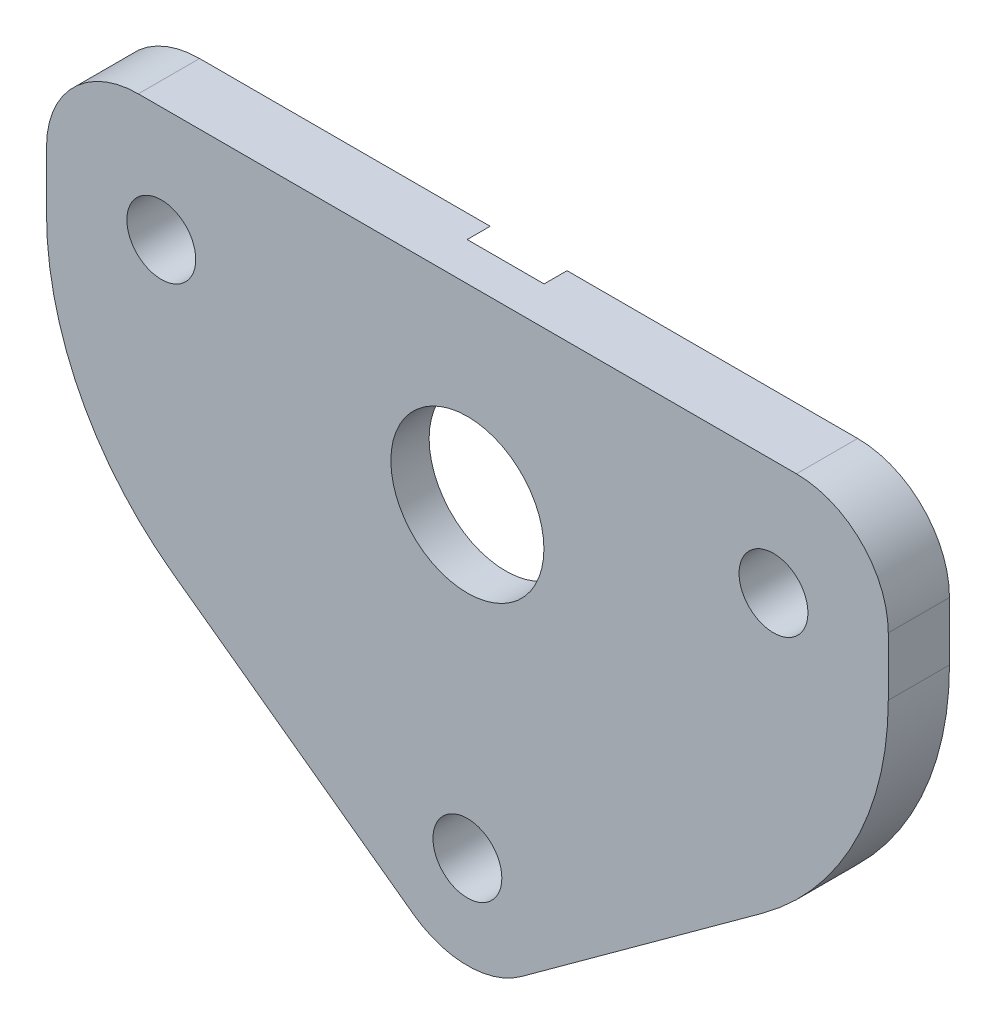
ISO-10303-21;
HEADER;
FILE_DESCRIPTION(('STEP AP214'),'2;1');
FILE_NAME('part.step','',(''),(''),'','','');
FILE_SCHEMA(('AUTOMOTIVE_DESIGN { 1 0 10303 214 1 1 1 1 }'));
ENDSEC;
DATA;
#1=APPLICATION_CONTEXT('core data for automotive mechanical design processes');
#2=APPLICATION_PROTOCOL_DEFINITION('international standard','automotive_design',2000,#1);
#3=PRODUCT_CONTEXT('',#1,'mechanical');
#4=PRODUCT('Part','Part','',(#3));
#5=PRODUCT_RELATED_PRODUCT_CATEGORY('part','',(#4));
#6=PRODUCT_DEFINITION_FORMATION('','',#4);
#7=PRODUCT_DEFINITION_CONTEXT('part definition',#1,'design');
#8=PRODUCT_DEFINITION('design','',#6,#7);
#9=PRODUCT_DEFINITION_SHAPE('','',#8);
#10=(LENGTH_UNIT() NAMED_UNIT(*) SI_UNIT(.MILLI.,.METRE.));
#11=(NAMED_UNIT(*) PLANE_ANGLE_UNIT() SI_UNIT($,.RADIAN.));
#12=(NAMED_UNIT(*) SI_UNIT($,.STERADIAN.) SOLID_ANGLE_UNIT());
#13=UNCERTAINTY_MEASURE_WITH_UNIT(LENGTH_MEASURE(1.E-05),#10,'distance_accuracy_value','');
#14=(GEOMETRIC_REPRESENTATION_CONTEXT(3) GLOBAL_UNCERTAINTY_ASSIGNED_CONTEXT((#13)) GLOBAL_UNIT_ASSIGNED_CONTEXT((#10,
#11,#12)) REPRESENTATION_CONTEXT('',''));
#15=CARTESIAN_POINT('',(0.,0.,0.));
#16=DIRECTION('',(0.,0.,1.));
#17=DIRECTION('',(1.,0.,0.));
#18=AXIS2_PLACEMENT_3D('',#15,#16,#17);
#19=CARTESIAN_POINT('',(-27.5,27.5,4.));
#20=DIRECTION('',(0.,0.,-1.));
#21=DIRECTION('',(-1.,0.,0.));
#22=AXIS2_PLACEMENT_3D('',#19,#20,#21);
#23=CYLINDRICAL_SURFACE('',#22,5.);
#24=CARTESIAN_POINT('',(-27.5,27.5,4.));
#25=DIRECTION('',(0.,0.,1.));
#26=DIRECTION('',(1.,0.,0.));
#27=AXIS2_PLACEMENT_3D('',#24,#25,#26);
#28=CIRCLE('',#27,5.);
#29=CARTESIAN_POINT('',(-22.5,27.5,4.));
#30=VERTEX_POINT('',#29);
#31=EDGE_CURVE('E224',#30,#30,#28,.T.);
#32=ORIENTED_EDGE('',*,*,#31,.T.);
#33=EDGE_LOOP('',(#32));
#34=FACE_BOUND('',#33,.T.);
#35=CARTESIAN_POINT('',(-27.5,27.5,1.5));
#36=DIRECTION('',(0.,0.,-1.));
#37=DIRECTION('',(-1.,0.,0.));
#38=AXIS2_PLACEMENT_3D('',#35,#36,#37);
#39=CIRCLE('',#38,5.);
#40=CARTESIAN_POINT('',(-32.5,27.5,1.5));
#41=VERTEX_POINT('',#40);
#42=EDGE_CURVE('E197',#41,#41,#39,.T.);
#43=ORIENTED_EDGE('',*,*,#42,.T.);
#44=EDGE_LOOP('',(#43));
#45=FACE_BOUND('',#44,.T.);
#46=ADVANCED_FACE('F33',(#34,#45),#23,.F.);
#47=CARTESIAN_POINT('',(0.,0.,4.));
#48=DIRECTION('',(0.,0.,1.));
#49=DIRECTION('',(1.,0.,0.));
#50=AXIS2_PLACEMENT_3D('',#47,#48,#49);
#51=PLANE('',#50);
#52=CARTESIAN_POINT('',(-7.5,32.5,4.));
#53=DIRECTION('',(0.,0.,1.));
#54=DIRECTION('',(1.,0.,0.));
#55=AXIS2_PLACEMENT_3D('',#52,#53,#54);
#56=CIRCLE('',#55,2.25);
#57=CARTESIAN_POINT('',(-5.25,32.5,4.));
#58=VERTEX_POINT('',#57);
#59=EDGE_CURVE('E240',#58,#58,#56,.T.);
#60=ORIENTED_EDGE('',*,*,#59,.F.);
#61=EDGE_LOOP('',(#60));
#62=FACE_BOUND('',#61,.T.);
#63=ORIENTED_EDGE('',*,*,#31,.F.);
#64=EDGE_LOOP('',(#63));
#65=FACE_BOUND('',#64,.T.);
#66=DIRECTION('',(0.,-1.,0.));
#67=VECTOR('',#66,1.);
#68=CARTESIAN_POINT('',(-55.,40.,4.));
#69=LINE('',#68,#67);
#70=CARTESIAN_POINT('',(-55.,34.,4.));
#71=VERTEX_POINT('',#70);
#72=CARTESIAN_POINT('',(-55.,30.1844918340644,4.));
#73=VERTEX_POINT('',#72);
#74=EDGE_CURVE('E144',#71,#73,#69,.T.);
#75=ORIENTED_EDGE('',*,*,#74,.T.);
#76=CARTESIAN_POINT('',(-35.,30.1844918340644,4.));
#77=DIRECTION('',(0.,0.,1.));
#78=DIRECTION('',(1.,0.,0.));
#79=AXIS2_PLACEMENT_3D('',#76,#77,#78);
#80=CIRCLE('',#79,20.);
#81=CARTESIAN_POINT('',(-46.7634339535009,14.0097701480007,4.));
#82=VERTEX_POINT('',#81);
#83=EDGE_CURVE('E190',#73,#82,#80,.T.);
#84=ORIENTED_EDGE('',*,*,#83,.T.);
#85=DIRECTION('',(0.808736084303188,-0.588171697675046,0.));
#86=VECTOR('',#85,1.);
#87=CARTESIAN_POINT('',(-55.,20.,4.));
#88=LINE('',#87,#86);
#89=CARTESIAN_POINT('',(-31.0290301860503,2.56656740803657,4.));
#90=VERTEX_POINT('',#89);
#91=EDGE_CURVE('E230',#82,#90,#88,.T.);
#92=ORIENTED_EDGE('',*,*,#91,.T.);
#93=CARTESIAN_POINT('',(-27.5,7.4189839138557,4.));
#94=DIRECTION('',(0.,0.,1.));
#95=DIRECTION('',(1.,0.,0.));
#96=AXIS2_PLACEMENT_3D('',#93,#94,#95);
#97=CIRCLE('',#96,6.);
#98=CARTESIAN_POINT('',(-23.9709698139497,2.56656740803657,4.));
#99=VERTEX_POINT('',#98);
#100=EDGE_CURVE('E167',#90,#99,#97,.T.);
#101=ORIENTED_EDGE('',*,*,#100,.T.);
#102=DIRECTION('',(0.808736084303188,0.588171697675046,0.));
#103=VECTOR('',#102,1.);
#104=CARTESIAN_POINT('',(-27.5,0.,4.));
#105=LINE('',#104,#103);
#106=CARTESIAN_POINT('',(-8.23656604649908,14.0097701480007,4.));
#107=VERTEX_POINT('',#106);
#108=EDGE_CURVE('E228',#99,#107,#105,.T.);
#109=ORIENTED_EDGE('',*,*,#108,.T.);
#110=CARTESIAN_POINT('',(-20.,30.1844918340644,4.));
#111=DIRECTION('',(0.,0.,1.));
#112=DIRECTION('',(1.,0.,0.));
#113=AXIS2_PLACEMENT_3D('',#110,#111,#112);
#114=CIRCLE('',#113,20.);
#115=CARTESIAN_POINT('',(0.,30.1844918340644,4.));
#116=VERTEX_POINT('',#115);
#117=EDGE_CURVE('E55',#107,#116,#114,.T.);
#118=ORIENTED_EDGE('',*,*,#117,.T.);
#119=DIRECTION('',(0.,1.,0.));
#120=VECTOR('',#119,1.);
#121=CARTESIAN_POINT('',(0.,40.,4.));
#122=LINE('',#121,#120);
#123=CARTESIAN_POINT('',(0.,34.,4.));
#124=VERTEX_POINT('',#123);
#125=EDGE_CURVE('E208',#116,#124,#122,.T.);
#126=ORIENTED_EDGE('',*,*,#125,.T.);
#127=CARTESIAN_POINT('',(-6.,34.,4.));
#128=DIRECTION('',(0.,0.,1.));
#129=DIRECTION('',(1.,0.,0.));
#130=AXIS2_PLACEMENT_3D('',#127,#128,#129);
#131=CIRCLE('',#130,6.);
#132=CARTESIAN_POINT('',(-6.,40.,4.));
#133=VERTEX_POINT('',#132);
#134=EDGE_CURVE('E163',#124,#133,#131,.T.);
#135=ORIENTED_EDGE('',*,*,#134,.T.);
#136=DIRECTION('',(-1.,0.,0.));
#137=VECTOR('',#136,1.);
#138=CARTESIAN_POINT('',(-55.,40.,4.));
#139=LINE('',#138,#137);
#140=CARTESIAN_POINT('',(-49.,40.,4.));
#141=VERTEX_POINT('',#140);
#142=EDGE_CURVE('E153',#133,#141,#139,.T.);
#143=ORIENTED_EDGE('',*,*,#142,.T.);
#144=CARTESIAN_POINT('',(-49.,34.,4.));
#145=DIRECTION('',(0.,0.,1.));
#146=DIRECTION('',(1.,0.,0.));
#147=AXIS2_PLACEMENT_3D('',#144,#145,#146);
#148=CIRCLE('',#147,6.);
#149=EDGE_CURVE('E165',#141,#71,#148,.T.);
#150=ORIENTED_EDGE('',*,*,#149,.T.);
#151=EDGE_LOOP('',(#75,#84,#92,#101,#109,#118,#126,#135,#143,#150));
#152=FACE_BOUND('',#151,.T.);
#153=CARTESIAN_POINT('',(-47.5,32.5,4.));
#154=DIRECTION('',(0.,0.,1.));
#155=DIRECTION('',(1.,0.,0.));
#156=AXIS2_PLACEMENT_3D('',#153,#154,#155);
#157=CIRCLE('',#156,2.25);
#158=CARTESIAN_POINT('',(-45.25,32.5,4.));
#159=VERTEX_POINT('',#158);
#160=EDGE_CURVE('E236',#159,#159,#157,.T.);
#161=ORIENTED_EDGE('',*,*,#160,.F.);
#162=EDGE_LOOP('',(#161));
#163=FACE_BOUND('',#162,.T.);
#164=CARTESIAN_POINT('',(-27.5,7.5,4.));
#165=DIRECTION('',(0.,0.,1.));
#166=DIRECTION('',(1.,0.,0.));
#167=AXIS2_PLACEMENT_3D('',#164,#165,#166);
#168=CIRCLE('',#167,2.25);
#169=CARTESIAN_POINT('',(-25.25,7.5,4.));
#170=VERTEX_POINT('',#169);
#171=EDGE_CURVE('E246',#170,#170,#168,.T.);
#172=ORIENTED_EDGE('',*,*,#171,.F.);
#173=EDGE_LOOP('',(#172));
#174=FACE_BOUND('',#173,.T.);
#175=ADVANCED_FACE('F265',(#62,#65,#152,#163,#174),#51,.T.);
#176=CARTESIAN_POINT('',(0.,0.,0.));
#177=DIRECTION('',(0.,0.,1.));
#178=DIRECTION('',(1.,0.,0.));
#179=AXIS2_PLACEMENT_3D('',#176,#177,#178);
#180=PLANE('',#179);
#181=DIRECTION('',(-1.,0.,0.));
#182=VECTOR('',#181,1.);
#183=CARTESIAN_POINT('',(-55.,40.,0.));
#184=LINE('',#183,#182);
#185=CARTESIAN_POINT('',(-30.0124689052802,40.,0.));
#186=VERTEX_POINT('',#185);
#187=CARTESIAN_POINT('',(-49.,40.,0.));
#188=VERTEX_POINT('',#187);
#189=EDGE_CURVE('E133',#186,#188,#184,.T.);
#190=ORIENTED_EDGE('',*,*,#189,.F.);
#191=CARTESIAN_POINT('',(-27.5,27.5,0.));
#192=DIRECTION('',(0.,0.,-1.));
#193=DIRECTION('',(-1.,0.,0.));
#194=AXIS2_PLACEMENT_3D('',#191,#192,#193);
#195=CIRCLE('',#194,12.75);
#196=CARTESIAN_POINT('',(-24.9875310947198,40.,0.));
#197=VERTEX_POINT('',#196);
#198=EDGE_CURVE('E122',#197,#186,#195,.T.);
#199=ORIENTED_EDGE('',*,*,#198,.F.);
#200=CARTESIAN_POINT('',(-6.,40.,0.));
#201=VERTEX_POINT('',#200);
#202=EDGE_CURVE('E141',#201,#197,#184,.T.);
#203=ORIENTED_EDGE('',*,*,#202,.F.);
#204=CARTESIAN_POINT('',(-6.,34.,0.));
#205=DIRECTION('',(0.,0.,1.));
#206=DIRECTION('',(1.,0.,0.));
#207=AXIS2_PLACEMENT_3D('',#204,#205,#206);
#208=CIRCLE('',#207,6.);
#209=CARTESIAN_POINT('',(0.,34.,0.));
#210=VERTEX_POINT('',#209);
#211=EDGE_CURVE('E152',#201,#210,#208,.F.);
#212=ORIENTED_EDGE('',*,*,#211,.T.);
#213=DIRECTION('',(0.,1.,0.));
#214=VECTOR('',#213,1.);
#215=CARTESIAN_POINT('',(0.,40.,0.));
#216=LINE('',#215,#214);
#217=CARTESIAN_POINT('',(0.,30.1844918340644,0.));
#218=VERTEX_POINT('',#217);
#219=EDGE_CURVE('E142',#218,#210,#216,.T.);
#220=ORIENTED_EDGE('',*,*,#219,.F.);
#221=CARTESIAN_POINT('',(-20.,30.1844918340644,0.));
#222=DIRECTION('',(0.,0.,1.));
#223=DIRECTION('',(1.,0.,0.));
#224=AXIS2_PLACEMENT_3D('',#221,#222,#223);
#225=CIRCLE('',#224,20.);
#226=CARTESIAN_POINT('',(-8.23656604649908,14.0097701480007,0.));
#227=VERTEX_POINT('',#226);
#228=EDGE_CURVE('E183',#218,#227,#225,.F.);
#229=ORIENTED_EDGE('',*,*,#228,.T.);
#230=DIRECTION('',(0.808736084303188,0.588171697675046,0.));
#231=VECTOR('',#230,1.);
#232=CARTESIAN_POINT('',(-27.5,0.,0.));
#233=LINE('',#232,#231);
#234=CARTESIAN_POINT('',(-23.9709698139497,2.56656740803657,0.));
#235=VERTEX_POINT('',#234);
#236=EDGE_CURVE('E145',#235,#227,#233,.T.);
#237=ORIENTED_EDGE('',*,*,#236,.F.);
#238=CARTESIAN_POINT('',(-27.5,7.4189839138557,0.));
#239=DIRECTION('',(0.,0.,1.));
#240=DIRECTION('',(1.,0.,0.));
#241=AXIS2_PLACEMENT_3D('',#238,#239,#240);
#242=CIRCLE('',#241,6.);
#243=CARTESIAN_POINT('',(-31.0290301860503,2.56656740803657,0.));
#244=VERTEX_POINT('',#243);
#245=EDGE_CURVE('E157',#235,#244,#242,.F.);
#246=ORIENTED_EDGE('',*,*,#245,.T.);
#247=DIRECTION('',(0.808736084303188,-0.588171697675046,0.));
#248=VECTOR('',#247,1.);
#249=CARTESIAN_POINT('',(-55.,20.,0.));
#250=LINE('',#249,#248);
#251=CARTESIAN_POINT('',(-46.7634339535009,14.0097701480007,0.));
#252=VERTEX_POINT('',#251);
#253=EDGE_CURVE('E218',#252,#244,#250,.T.);
#254=ORIENTED_EDGE('',*,*,#253,.F.);
#255=CARTESIAN_POINT('',(-35.,30.1844918340644,0.));
#256=DIRECTION('',(0.,0.,1.));
#257=DIRECTION('',(1.,0.,0.));
#258=AXIS2_PLACEMENT_3D('',#255,#256,#257);
#259=CIRCLE('',#258,20.);
#260=CARTESIAN_POINT('',(-55.,30.1844918340644,0.));
#261=VERTEX_POINT('',#260);
#262=EDGE_CURVE('E185',#252,#261,#259,.F.);
#263=ORIENTED_EDGE('',*,*,#262,.T.);
#264=DIRECTION('',(0.,-1.,0.));
#265=VECTOR('',#264,1.);
#266=CARTESIAN_POINT('',(-55.,40.,0.));
#267=LINE('',#266,#265);
#268=CARTESIAN_POINT('',(-55.,34.,0.));
#269=VERTEX_POINT('',#268);
#270=EDGE_CURVE('E219',#269,#261,#267,.T.);
#271=ORIENTED_EDGE('',*,*,#270,.F.);
#272=CARTESIAN_POINT('',(-49.,34.,0.));
#273=DIRECTION('',(0.,0.,1.));
#274=DIRECTION('',(1.,0.,0.));
#275=AXIS2_PLACEMENT_3D('',#272,#273,#274);
#276=CIRCLE('',#275,6.);
#277=EDGE_CURVE('E139',#269,#188,#276,.F.);
#278=ORIENTED_EDGE('',*,*,#277,.T.);
#279=EDGE_LOOP('',(#190,#199,#203,#212,#220,#229,#237,#246,#254,#263,#271,#278));
#280=FACE_BOUND('',#279,.T.);
#281=CARTESIAN_POINT('',(-47.5,32.5,0.));
#282=DIRECTION('',(0.,0.,1.));
#283=DIRECTION('',(1.,0.,0.));
#284=AXIS2_PLACEMENT_3D('',#281,#282,#283);
#285=CIRCLE('',#284,2.25);
#286=CARTESIAN_POINT('',(-45.25,32.5,0.));
#287=VERTEX_POINT('',#286);
#288=EDGE_CURVE('E237',#287,#287,#285,.T.);
#289=ORIENTED_EDGE('',*,*,#288,.T.);
#290=EDGE_LOOP('',(#289));
#291=FACE_BOUND('',#290,.T.);
#292=CARTESIAN_POINT('',(-7.5,32.5,0.));
#293=DIRECTION('',(0.,0.,1.));
#294=DIRECTION('',(1.,0.,0.));
#295=AXIS2_PLACEMENT_3D('',#292,#293,#294);
#296=CIRCLE('',#295,2.25);
#297=CARTESIAN_POINT('',(-5.25,32.5,0.));
#298=VERTEX_POINT('',#297);
#299=EDGE_CURVE('E243',#298,#298,#296,.T.);
#300=ORIENTED_EDGE('',*,*,#299,.T.);
#301=EDGE_LOOP('',(#300));
#302=FACE_BOUND('',#301,.T.);
#303=CARTESIAN_POINT('',(-27.5,7.5,0.));
#304=DIRECTION('',(0.,0.,1.));
#305=DIRECTION('',(1.,0.,0.));
#306=AXIS2_PLACEMENT_3D('',#303,#304,#305);
#307=CIRCLE('',#306,2.25);
#308=CARTESIAN_POINT('',(-25.25,7.5,0.));
#309=VERTEX_POINT('',#308);
#310=EDGE_CURVE('E249',#309,#309,#307,.T.);
#311=ORIENTED_EDGE('',*,*,#310,.T.);
#312=EDGE_LOOP('',(#311));
#313=FACE_BOUND('',#312,.T.);
#314=ADVANCED_FACE('F136',(#280,#291,#302,#313),#180,.F.);
#315=CARTESIAN_POINT('',(-55.,40.,4.));
#316=DIRECTION('',(1.,0.,0.));
#317=DIRECTION('',(0.,1.,0.));
#318=AXIS2_PLACEMENT_3D('',#315,#316,#317);
#319=PLANE('',#318);
#320=ORIENTED_EDGE('',*,*,#270,.T.);
#321=DIRECTION('',(0.,0.,-1.));
#322=VECTOR('',#321,1.);
#323=CARTESIAN_POINT('',(-55.,30.1844918340644,4.));
#324=LINE('',#323,#322);
#325=EDGE_CURVE('E187',#261,#73,#324,.F.);
#326=ORIENTED_EDGE('',*,*,#325,.T.);
#327=ORIENTED_EDGE('',*,*,#74,.F.);
#328=DIRECTION('',(0.,0.,-1.));
#329=VECTOR('',#328,1.);
#330=CARTESIAN_POINT('',(-55.,34.,4.));
#331=LINE('',#330,#329);
#332=EDGE_CURVE('E169',#71,#269,#331,.T.);
#333=ORIENTED_EDGE('',*,*,#332,.T.);
#334=EDGE_LOOP('',(#320,#326,#327,#333));
#335=FACE_BOUND('',#334,.T.);
#336=ADVANCED_FACE('F280',(#335),#319,.F.);
#337=CARTESIAN_POINT('',(-55.,20.,4.));
#338=DIRECTION('',(0.588171697675046,0.808736084303189,0.));
#339=DIRECTION('',(-0.808736084303189,0.588171697675046,0.));
#340=AXIS2_PLACEMENT_3D('',#337,#338,#339);
#341=PLANE('',#340);
#342=ORIENTED_EDGE('',*,*,#91,.F.);
#343=DIRECTION('',(0.,0.,-1.));
#344=VECTOR('',#343,1.);
#345=CARTESIAN_POINT('',(-46.7634339535009,14.0097701480007,4.));
#346=LINE('',#345,#344);
#347=EDGE_CURVE('E180',#82,#252,#346,.T.);
#348=ORIENTED_EDGE('',*,*,#347,.T.);
#349=ORIENTED_EDGE('',*,*,#253,.T.);
#350=DIRECTION('',(0.,0.,-1.));
#351=VECTOR('',#350,1.);
#352=CARTESIAN_POINT('',(-31.0290301860503,2.56656740803657,4.));
#353=LINE('',#352,#351);
#354=EDGE_CURVE('E160',#244,#90,#353,.F.);
#355=ORIENTED_EDGE('',*,*,#354,.T.);
#356=EDGE_LOOP('',(#342,#348,#349,#355));
#357=FACE_BOUND('',#356,.T.);
#358=ADVANCED_FACE('F287',(#357),#341,.F.);
#359=CARTESIAN_POINT('',(-27.5,0.,4.));
#360=DIRECTION('',(-0.588171697675046,0.808736084303189,0.));
#361=DIRECTION('',(-0.808736084303189,-0.588171697675046,0.));
#362=AXIS2_PLACEMENT_3D('',#359,#360,#361);
#363=PLANE('',#362);
#364=ORIENTED_EDGE('',*,*,#236,.T.);
#365=DIRECTION('',(0.,0.,-1.));
#366=VECTOR('',#365,1.);
#367=CARTESIAN_POINT('',(-8.23656604649908,14.0097701480007,4.));
#368=LINE('',#367,#366);
#369=EDGE_CURVE('E195',#227,#107,#368,.F.);
#370=ORIENTED_EDGE('',*,*,#369,.T.);
#371=ORIENTED_EDGE('',*,*,#108,.F.);
#372=DIRECTION('',(0.,0.,-1.));
#373=VECTOR('',#372,1.);
#374=CARTESIAN_POINT('',(-23.9709698139497,2.56656740803657,4.));
#375=LINE('',#374,#373);
#376=EDGE_CURVE('E149',#99,#235,#375,.T.);
#377=ORIENTED_EDGE('',*,*,#376,.T.);
#378=EDGE_LOOP('',(#364,#370,#371,#377));
#379=FACE_BOUND('',#378,.T.);
#380=ADVANCED_FACE('F215',(#379),#363,.F.);
#381=CARTESIAN_POINT('',(0.,40.,4.));
#382=DIRECTION('',(-1.,0.,0.));
#383=DIRECTION('',(0.,0.,1.));
#384=AXIS2_PLACEMENT_3D('',#381,#382,#383);
#385=PLANE('',#384);
#386=ORIENTED_EDGE('',*,*,#125,.F.);
#387=DIRECTION('',(0.,0.,-1.));
#388=VECTOR('',#387,1.);
#389=CARTESIAN_POINT('',(0.,30.1844918340644,4.));
#390=LINE('',#389,#388);
#391=EDGE_CURVE('E192',#116,#218,#390,.T.);
#392=ORIENTED_EDGE('',*,*,#391,.T.);
#393=ORIENTED_EDGE('',*,*,#219,.T.);
#394=DIRECTION('',(0.,0.,-1.));
#395=VECTOR('',#394,1.);
#396=CARTESIAN_POINT('',(0.,34.,4.));
#397=LINE('',#396,#395);
#398=EDGE_CURVE('E177',#210,#124,#397,.F.);
#399=ORIENTED_EDGE('',*,*,#398,.T.);
#400=EDGE_LOOP('',(#386,#392,#393,#399));
#401=FACE_BOUND('',#400,.T.);
#402=ADVANCED_FACE('F207',(#401),#385,.F.);
#403=CARTESIAN_POINT('',(-55.,40.,4.));
#404=DIRECTION('',(0.,-1.,0.));
#405=DIRECTION('',(0.,0.,-1.));
#406=AXIS2_PLACEMENT_3D('',#403,#404,#405);
#407=PLANE('',#406);
#408=DIRECTION('',(1.,0.,0.));
#409=VECTOR('',#408,1.);
#410=CARTESIAN_POINT('',(-55.,40.,1.5));
#411=LINE('',#410,#409);
#412=CARTESIAN_POINT('',(-30.0124689052802,40.,1.5));
#413=VERTEX_POINT('',#412);
#414=CARTESIAN_POINT('',(-24.9875310947198,40.,1.5));
#415=VERTEX_POINT('',#414);
#416=EDGE_CURVE('E135',#413,#415,#411,.T.);
#417=ORIENTED_EDGE('',*,*,#416,.F.);
#418=DIRECTION('',(0.,0.,-1.));
#419=VECTOR('',#418,1.);
#420=CARTESIAN_POINT('',(-30.0124689052802,40.,1.5));
#421=LINE('',#420,#419);
#422=EDGE_CURVE('E11',#413,#186,#421,.T.);
#423=ORIENTED_EDGE('',*,*,#422,.T.);
#424=ORIENTED_EDGE('',*,*,#189,.T.);
#425=DIRECTION('',(0.,0.,-1.));
#426=VECTOR('',#425,1.);
#427=CARTESIAN_POINT('',(-49.,40.,4.));
#428=LINE('',#427,#426);
#429=EDGE_CURVE('E175',#188,#141,#428,.F.);
#430=ORIENTED_EDGE('',*,*,#429,.T.);
#431=ORIENTED_EDGE('',*,*,#142,.F.);
#432=DIRECTION('',(0.,0.,-1.));
#433=VECTOR('',#432,1.);
#434=CARTESIAN_POINT('',(-6.,40.,4.));
#435=LINE('',#434,#433);
#436=EDGE_CURVE('E172',#133,#201,#435,.T.);
#437=ORIENTED_EDGE('',*,*,#436,.T.);
#438=ORIENTED_EDGE('',*,*,#202,.T.);
#439=DIRECTION('',(0.,0.,-1.));
#440=VECTOR('',#439,1.);
#441=CARTESIAN_POINT('',(-24.9875310947198,40.,1.5));
#442=LINE('',#441,#440);
#443=EDGE_CURVE('E41',#197,#415,#442,.F.);
#444=ORIENTED_EDGE('',*,*,#443,.T.);
#445=EDGE_LOOP('',(#417,#423,#424,#430,#431,#437,#438,#444));
#446=FACE_BOUND('',#445,.T.);
#447=ADVANCED_FACE('F132',(#446),#407,.F.);
#448=CARTESIAN_POINT('',(-47.5,32.5,4.));
#449=DIRECTION('',(0.,0.,-1.));
#450=DIRECTION('',(-1.,0.,0.));
#451=AXIS2_PLACEMENT_3D('',#448,#449,#450);
#452=CYLINDRICAL_SURFACE('',#451,2.25);
#453=ORIENTED_EDGE('',*,*,#160,.T.);
#454=EDGE_LOOP('',(#453));
#455=FACE_BOUND('',#454,.T.);
#456=ORIENTED_EDGE('',*,*,#288,.F.);
#457=EDGE_LOOP('',(#456));
#458=FACE_BOUND('',#457,.T.);
#459=ADVANCED_FACE('F275',(#455,#458),#452,.F.);
#460=CARTESIAN_POINT('',(-7.5,32.5,4.));
#461=DIRECTION('',(0.,0.,-1.));
#462=DIRECTION('',(-1.,0.,0.));
#463=AXIS2_PLACEMENT_3D('',#460,#461,#462);
#464=CYLINDRICAL_SURFACE('',#463,2.25);
#465=ORIENTED_EDGE('',*,*,#59,.T.);
#466=EDGE_LOOP('',(#465));
#467=FACE_BOUND('',#466,.T.);
#468=ORIENTED_EDGE('',*,*,#299,.F.);
#469=EDGE_LOOP('',(#468));
#470=FACE_BOUND('',#469,.T.);
#471=ADVANCED_FACE('F327',(#467,#470),#464,.F.);
#472=CARTESIAN_POINT('',(-27.5,7.5,4.));
#473=DIRECTION('',(0.,0.,-1.));
#474=DIRECTION('',(-1.,0.,0.));
#475=AXIS2_PLACEMENT_3D('',#472,#473,#474);
#476=CYLINDRICAL_SURFACE('',#475,2.25);
#477=ORIENTED_EDGE('',*,*,#171,.T.);
#478=EDGE_LOOP('',(#477));
#479=FACE_BOUND('',#478,.T.);
#480=ORIENTED_EDGE('',*,*,#310,.F.);
#481=EDGE_LOOP('',(#480));
#482=FACE_BOUND('',#481,.T.);
#483=ADVANCED_FACE('F298',(#479,#482),#476,.F.);
#484=CARTESIAN_POINT('',(-27.5,7.4189839138557,4.));
#485=DIRECTION('',(0.,0.,-1.));
#486=DIRECTION('',(-1.,0.,0.));
#487=AXIS2_PLACEMENT_3D('',#484,#485,#486);
#488=CYLINDRICAL_SURFACE('',#487,6.);
#489=ORIENTED_EDGE('',*,*,#100,.F.);
#490=ORIENTED_EDGE('',*,*,#354,.F.);
#491=ORIENTED_EDGE('',*,*,#245,.F.);
#492=ORIENTED_EDGE('',*,*,#376,.F.);
#493=EDGE_LOOP('',(#489,#490,#491,#492));
#494=FACE_BOUND('',#493,.T.);
#495=ADVANCED_FACE('F294',(#494),#488,.T.);
#496=CARTESIAN_POINT('',(-49.,34.,4.));
#497=DIRECTION('',(0.,0.,-1.));
#498=DIRECTION('',(-1.,0.,0.));
#499=AXIS2_PLACEMENT_3D('',#496,#497,#498);
#500=CYLINDRICAL_SURFACE('',#499,6.);
#501=ORIENTED_EDGE('',*,*,#149,.F.);
#502=ORIENTED_EDGE('',*,*,#429,.F.);
#503=ORIENTED_EDGE('',*,*,#277,.F.);
#504=ORIENTED_EDGE('',*,*,#332,.F.);
#505=EDGE_LOOP('',(#501,#502,#503,#504));
#506=FACE_BOUND('',#505,.T.);
#507=ADVANCED_FACE('F297',(#506),#500,.T.);
#508=CARTESIAN_POINT('',(-6.,34.,4.));
#509=DIRECTION('',(0.,0.,-1.));
#510=DIRECTION('',(-1.,0.,0.));
#511=AXIS2_PLACEMENT_3D('',#508,#509,#510);
#512=CYLINDRICAL_SURFACE('',#511,6.);
#513=ORIENTED_EDGE('',*,*,#134,.F.);
#514=ORIENTED_EDGE('',*,*,#398,.F.);
#515=ORIENTED_EDGE('',*,*,#211,.F.);
#516=ORIENTED_EDGE('',*,*,#436,.F.);
#517=EDGE_LOOP('',(#513,#514,#515,#516));
#518=FACE_BOUND('',#517,.T.);
#519=ADVANCED_FACE('F205',(#518),#512,.T.);
#520=CARTESIAN_POINT('',(-35.,30.1844918340644,4.));
#521=DIRECTION('',(0.,0.,-1.));
#522=DIRECTION('',(-1.,0.,0.));
#523=AXIS2_PLACEMENT_3D('',#520,#521,#522);
#524=CYLINDRICAL_SURFACE('',#523,20.);
#525=ORIENTED_EDGE('',*,*,#83,.F.);
#526=ORIENTED_EDGE('',*,*,#325,.F.);
#527=ORIENTED_EDGE('',*,*,#262,.F.);
#528=ORIENTED_EDGE('',*,*,#347,.F.);
#529=EDGE_LOOP('',(#525,#526,#527,#528));
#530=FACE_BOUND('',#529,.T.);
#531=ADVANCED_FACE('F304',(#530),#524,.T.);
#532=CARTESIAN_POINT('',(-20.,30.1844918340644,4.));
#533=DIRECTION('',(0.,0.,-1.));
#534=DIRECTION('',(-1.,0.,0.));
#535=AXIS2_PLACEMENT_3D('',#532,#533,#534);
#536=CYLINDRICAL_SURFACE('',#535,20.);
#537=ORIENTED_EDGE('',*,*,#117,.F.);
#538=ORIENTED_EDGE('',*,*,#369,.F.);
#539=ORIENTED_EDGE('',*,*,#228,.F.);
#540=ORIENTED_EDGE('',*,*,#391,.F.);
#541=EDGE_LOOP('',(#537,#538,#539,#540));
#542=FACE_BOUND('',#541,.T.);
#543=ADVANCED_FACE('F35',(#542),#536,.T.);
#544=CARTESIAN_POINT('',(-27.5,27.5,1.5));
#545=DIRECTION('',(0.,0.,-1.));
#546=DIRECTION('',(-1.,0.,0.));
#547=AXIS2_PLACEMENT_3D('',#544,#545,#546);
#548=CYLINDRICAL_SURFACE('',#547,12.75);
#549=CARTESIAN_POINT('',(-27.5,27.5,1.5));
#550=DIRECTION('',(0.,0.,-1.));
#551=DIRECTION('',(-1.,0.,0.));
#552=AXIS2_PLACEMENT_3D('',#549,#550,#551);
#553=CIRCLE('',#552,12.75);
#554=EDGE_CURVE('E47',#415,#413,#553,.T.);
#555=ORIENTED_EDGE('',*,*,#554,.F.);
#556=ORIENTED_EDGE('',*,*,#443,.F.);
#557=ORIENTED_EDGE('',*,*,#198,.T.);
#558=ORIENTED_EDGE('',*,*,#422,.F.);
#559=EDGE_LOOP('',(#555,#556,#557,#558));
#560=FACE_BOUND('',#559,.T.);
#561=ADVANCED_FACE('F123',(#560),#548,.F.);
#562=CARTESIAN_POINT('',(-27.5,27.5,1.5));
#563=DIRECTION('',(0.,0.,-1.));
#564=DIRECTION('',(-1.,0.,0.));
#565=AXIS2_PLACEMENT_3D('',#562,#563,#564);
#566=PLANE('',#565);
#567=ORIENTED_EDGE('',*,*,#42,.F.);
#568=EDGE_LOOP('',(#567));
#569=FACE_BOUND('',#568,.T.);
#570=ORIENTED_EDGE('',*,*,#416,.T.);
#571=ORIENTED_EDGE('',*,*,#554,.T.);
#572=EDGE_LOOP('',(#570,#571));
#573=FACE_BOUND('',#572,.T.);
#574=ADVANCED_FACE('F255',(#569,#573),#566,.T.);
#575=CLOSED_SHELL('',(#46,#175,#314,#336,#358,#380,#402,#447,#459,#471,#483,#495,#507,#519,#531,
#543,#561,#574));
#576=MANIFOLD_SOLID_BREP('B2',#575);
#577=ADVANCED_BREP_SHAPE_REPRESENTATION('',(#18,#576),#14);
#578=SHAPE_DEFINITION_REPRESENTATION(#9,#577);
ENDSEC;
END-ISO-10303-21;
